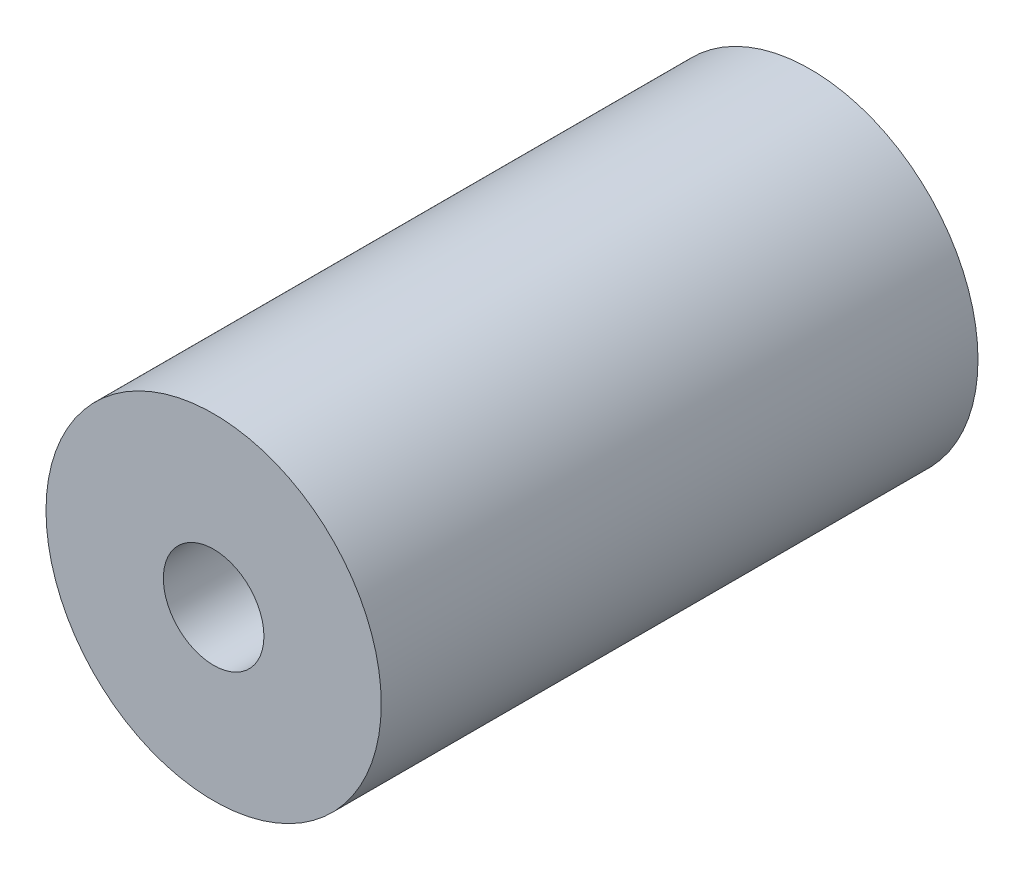
ISO-10303-21;
HEADER;
FILE_DESCRIPTION(('STEP AP214'),'2;1');
FILE_NAME('part.step','',(''),(''),'','','');
FILE_SCHEMA(('AUTOMOTIVE_DESIGN { 1 0 10303 214 1 1 1 1 }'));
ENDSEC;
DATA;
#1=APPLICATION_CONTEXT('core data for automotive mechanical design processes');
#2=APPLICATION_PROTOCOL_DEFINITION('international standard','automotive_design',2000,#1);
#3=PRODUCT_CONTEXT('',#1,'mechanical');
#4=PRODUCT('Part','Part','',(#3));
#5=PRODUCT_RELATED_PRODUCT_CATEGORY('part','',(#4));
#6=PRODUCT_DEFINITION_FORMATION('','',#4);
#7=PRODUCT_DEFINITION_CONTEXT('part definition',#1,'design');
#8=PRODUCT_DEFINITION('design','',#6,#7);
#9=PRODUCT_DEFINITION_SHAPE('','',#8);
#10=(LENGTH_UNIT() NAMED_UNIT(*) SI_UNIT(.MILLI.,.METRE.));
#11=(NAMED_UNIT(*) PLANE_ANGLE_UNIT() SI_UNIT($,.RADIAN.));
#12=(NAMED_UNIT(*) SI_UNIT($,.STERADIAN.) SOLID_ANGLE_UNIT());
#13=UNCERTAINTY_MEASURE_WITH_UNIT(LENGTH_MEASURE(1.E-05),#10,'distance_accuracy_value','');
#14=(GEOMETRIC_REPRESENTATION_CONTEXT(3) GLOBAL_UNCERTAINTY_ASSIGNED_CONTEXT((#13)) GLOBAL_UNIT_ASSIGNED_CONTEXT((#10,
#11,#12)) REPRESENTATION_CONTEXT('',''));
#15=CARTESIAN_POINT('',(0.,0.,0.));
#16=DIRECTION('',(0.,0.,1.));
#17=DIRECTION('',(1.,0.,0.));
#18=AXIS2_PLACEMENT_3D('',#15,#16,#17);
#19=CARTESIAN_POINT('',(0.,0.,17.8));
#20=DIRECTION('',(0.,0.,-1.));
#21=DIRECTION('',(-1.,0.,0.));
#22=AXIS2_PLACEMENT_3D('',#19,#20,#21);
#23=CYLINDRICAL_SURFACE('',#22,5.);
#24=CARTESIAN_POINT('',(0.,0.,17.8));
#25=DIRECTION('',(0.,0.,1.));
#26=DIRECTION('',(1.,0.,0.));
#27=AXIS2_PLACEMENT_3D('',#24,#25,#26);
#28=CIRCLE('',#27,5.);
#29=CARTESIAN_POINT('',(5.,0.,17.8));
#30=VERTEX_POINT('',#29);
#31=EDGE_CURVE('E10',#30,#30,#28,.T.);
#32=ORIENTED_EDGE('',*,*,#31,.F.);
#33=EDGE_LOOP('',(#32));
#34=FACE_BOUND('',#33,.T.);
#35=CARTESIAN_POINT('',(0.,0.,0.));
#36=DIRECTION('',(0.,0.,1.));
#37=DIRECTION('',(1.,0.,0.));
#38=AXIS2_PLACEMENT_3D('',#35,#36,#37);
#39=CIRCLE('',#38,5.);
#40=CARTESIAN_POINT('',(5.,0.,0.));
#41=VERTEX_POINT('',#40);
#42=EDGE_CURVE('E36',#41,#41,#39,.T.);
#43=ORIENTED_EDGE('',*,*,#42,.T.);
#44=EDGE_LOOP('',(#43));
#45=FACE_BOUND('',#44,.T.);
#46=ADVANCED_FACE('F33',(#34,#45),#23,.T.);
#47=CARTESIAN_POINT('',(0.,0.,17.8));
#48=DIRECTION('',(0.,0.,1.));
#49=DIRECTION('',(1.,0.,0.));
#50=AXIS2_PLACEMENT_3D('',#47,#48,#49);
#51=PLANE('',#50);
#52=CARTESIAN_POINT('',(0.,0.,17.8));
#53=DIRECTION('',(0.,0.,1.));
#54=DIRECTION('',(1.,0.,0.));
#55=AXIS2_PLACEMENT_3D('',#52,#53,#54);
#56=CIRCLE('',#55,1.5);
#57=CARTESIAN_POINT('',(1.5,0.,17.8));
#58=VERTEX_POINT('',#57);
#59=EDGE_CURVE('E47',#58,#58,#56,.T.);
#60=ORIENTED_EDGE('',*,*,#59,.F.);
#61=EDGE_LOOP('',(#60));
#62=FACE_BOUND('',#61,.T.);
#63=ORIENTED_EDGE('',*,*,#31,.T.);
#64=EDGE_LOOP('',(#63));
#65=FACE_BOUND('',#64,.T.);
#66=ADVANCED_FACE('F53',(#62,#65),#51,.T.);
#67=CARTESIAN_POINT('',(0.,0.,0.));
#68=DIRECTION('',(0.,0.,1.));
#69=DIRECTION('',(1.,0.,0.));
#70=AXIS2_PLACEMENT_3D('',#67,#68,#69);
#71=PLANE('',#70);
#72=CARTESIAN_POINT('',(0.,0.,0.));
#73=DIRECTION('',(0.,0.,1.));
#74=DIRECTION('',(1.,0.,0.));
#75=AXIS2_PLACEMENT_3D('',#72,#73,#74);
#76=CIRCLE('',#75,1.5);
#77=CARTESIAN_POINT('',(1.5,0.,0.));
#78=VERTEX_POINT('',#77);
#79=EDGE_CURVE('E43',#78,#78,#76,.T.);
#80=ORIENTED_EDGE('',*,*,#79,.T.);
#81=EDGE_LOOP('',(#80));
#82=FACE_BOUND('',#81,.T.);
#83=ORIENTED_EDGE('',*,*,#42,.F.);
#84=EDGE_LOOP('',(#83));
#85=FACE_BOUND('',#84,.T.);
#86=ADVANCED_FACE('F55',(#82,#85),#71,.F.);
#87=CARTESIAN_POINT('',(0.,0.,17.8));
#88=DIRECTION('',(0.,0.,1.));
#89=DIRECTION('',(1.,0.,0.));
#90=AXIS2_PLACEMENT_3D('',#87,#88,#89);
#91=CYLINDRICAL_SURFACE('',#90,1.5);
#92=ORIENTED_EDGE('',*,*,#79,.F.);
#93=EDGE_LOOP('',(#92));
#94=FACE_BOUND('',#93,.T.);
#95=ORIENTED_EDGE('',*,*,#59,.T.);
#96=EDGE_LOOP('',(#95));
#97=FACE_BOUND('',#96,.T.);
#98=ADVANCED_FACE('F51',(#94,#97),#91,.F.);
#99=CLOSED_SHELL('',(#46,#66,#86,#98));
#100=MANIFOLD_SOLID_BREP('B2',#99);
#101=ADVANCED_BREP_SHAPE_REPRESENTATION('',(#18,#100),#14);
#102=SHAPE_DEFINITION_REPRESENTATION(#9,#101);
ENDSEC;
END-ISO-10303-21;
